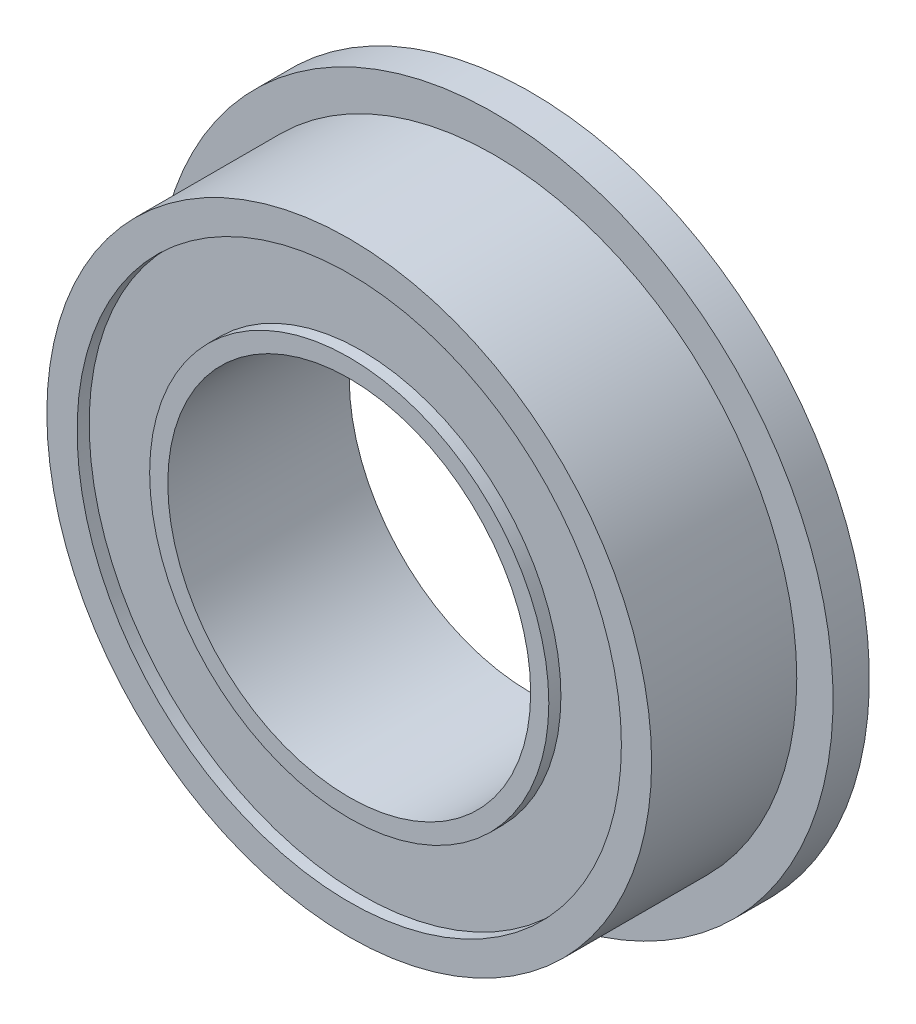
ISO-10303-21;
HEADER;
FILE_DESCRIPTION(('STEP AP214'),'2;1');
FILE_NAME('part.step','',(''),(''),'','','');
FILE_SCHEMA(('AUTOMOTIVE_DESIGN { 1 0 10303 214 1 1 1 1 }'));
ENDSEC;
DATA;
#1=APPLICATION_CONTEXT('core data for automotive mechanical design processes');
#2=APPLICATION_PROTOCOL_DEFINITION('international standard','automotive_design',2000,#1);
#3=PRODUCT_CONTEXT('',#1,'mechanical');
#4=PRODUCT('Part','Part','',(#3));
#5=PRODUCT_RELATED_PRODUCT_CATEGORY('part','',(#4));
#6=PRODUCT_DEFINITION_FORMATION('','',#4);
#7=PRODUCT_DEFINITION_CONTEXT('part definition',#1,'design');
#8=PRODUCT_DEFINITION('design','',#6,#7);
#9=PRODUCT_DEFINITION_SHAPE('','',#8);
#10=(LENGTH_UNIT() NAMED_UNIT(*) SI_UNIT(.MILLI.,.METRE.));
#11=(NAMED_UNIT(*) PLANE_ANGLE_UNIT() SI_UNIT($,.RADIAN.));
#12=(NAMED_UNIT(*) SI_UNIT($,.STERADIAN.) SOLID_ANGLE_UNIT());
#13=UNCERTAINTY_MEASURE_WITH_UNIT(LENGTH_MEASURE(1.E-05),#10,'distance_accuracy_value','');
#14=(GEOMETRIC_REPRESENTATION_CONTEXT(3) GLOBAL_UNCERTAINTY_ASSIGNED_CONTEXT((#13)) GLOBAL_UNIT_ASSIGNED_CONTEXT((#10,
#11,#12)) REPRESENTATION_CONTEXT('',''));
#15=CARTESIAN_POINT('',(0.,0.,0.));
#16=DIRECTION('',(0.,0.,1.));
#17=DIRECTION('',(1.,0.,0.));
#18=AXIS2_PLACEMENT_3D('',#15,#16,#17);
#19=CARTESIAN_POINT('',(0.,0.,-1.5));
#20=DIRECTION('',(0.,0.,1.));
#21=DIRECTION('',(1.,0.,0.));
#22=AXIS2_PLACEMENT_3D('',#19,#20,#21);
#23=PLANE('',#22);
#24=CARTESIAN_POINT('',(0.,0.,-1.5));
#25=DIRECTION('',(0.,0.,1.));
#26=DIRECTION('',(1.,0.,0.));
#27=AXIS2_PLACEMENT_3D('',#24,#25,#26);
#28=CIRCLE('',#27,3.);
#29=CARTESIAN_POINT('',(3.,0.,-1.5));
#30=VERTEX_POINT('',#29);
#31=EDGE_CURVE('E60',#30,#30,#28,.T.);
#32=ORIENTED_EDGE('',*,*,#31,.T.);
#33=EDGE_LOOP('',(#32));
#34=FACE_BOUND('',#33,.T.);
#35=CARTESIAN_POINT('',(0.,0.,-1.5));
#36=DIRECTION('',(0.,0.,1.));
#37=DIRECTION('',(1.,0.,0.));
#38=AXIS2_PLACEMENT_3D('',#35,#36,#37);
#39=CIRCLE('',#38,3.3);
#40=CARTESIAN_POINT('',(3.3,0.,-1.5));
#41=VERTEX_POINT('',#40);
#42=EDGE_CURVE('E94',#41,#41,#39,.T.);
#43=ORIENTED_EDGE('',*,*,#42,.F.);
#44=EDGE_LOOP('',(#43));
#45=FACE_BOUND('',#44,.T.);
#46=ADVANCED_FACE('F37',(#34,#45),#23,.F.);
#47=CARTESIAN_POINT('',(0.,0.,1.5));
#48=DIRECTION('',(0.,0.,1.));
#49=DIRECTION('',(1.,0.,0.));
#50=AXIS2_PLACEMENT_3D('',#47,#48,#49);
#51=PLANE('',#50);
#52=CARTESIAN_POINT('',(0.,0.,1.5));
#53=DIRECTION('',(0.,0.,1.));
#54=DIRECTION('',(1.,0.,0.));
#55=AXIS2_PLACEMENT_3D('',#52,#53,#54);
#56=CIRCLE('',#55,3.);
#57=CARTESIAN_POINT('',(3.,0.,1.5));
#58=VERTEX_POINT('',#57);
#59=EDGE_CURVE('E62',#58,#58,#56,.T.);
#60=ORIENTED_EDGE('',*,*,#59,.F.);
#61=EDGE_LOOP('',(#60));
#62=FACE_BOUND('',#61,.T.);
#63=CARTESIAN_POINT('',(0.,0.,1.5));
#64=DIRECTION('',(0.,0.,1.));
#65=DIRECTION('',(1.,0.,0.));
#66=AXIS2_PLACEMENT_3D('',#63,#64,#65);
#67=CIRCLE('',#66,3.3);
#68=CARTESIAN_POINT('',(3.3,0.,1.5));
#69=VERTEX_POINT('',#68);
#70=EDGE_CURVE('E78',#69,#69,#67,.T.);
#71=ORIENTED_EDGE('',*,*,#70,.T.);
#72=EDGE_LOOP('',(#71));
#73=FACE_BOUND('',#72,.T.);
#74=ADVANCED_FACE('F112',(#62,#73),#51,.T.);
#75=CARTESIAN_POINT('',(0.,0.,1.5));
#76=DIRECTION('',(0.,0.,-1.));
#77=DIRECTION('',(-1.,0.,0.));
#78=AXIS2_PLACEMENT_3D('',#75,#76,#77);
#79=CYLINDRICAL_SURFACE('',#78,5.);
#80=CARTESIAN_POINT('',(0.,0.,1.5));
#81=DIRECTION('',(0.,0.,1.));
#82=DIRECTION('',(1.,0.,0.));
#83=AXIS2_PLACEMENT_3D('',#80,#81,#82);
#84=CIRCLE('',#83,5.);
#85=CARTESIAN_POINT('',(5.,0.,1.5));
#86=VERTEX_POINT('',#85);
#87=EDGE_CURVE('E45',#86,#86,#84,.T.);
#88=ORIENTED_EDGE('',*,*,#87,.F.);
#89=EDGE_LOOP('',(#88));
#90=FACE_BOUND('',#89,.T.);
#91=CARTESIAN_POINT('',(0.,0.,-0.9));
#92=DIRECTION('',(0.,0.,-1.));
#93=DIRECTION('',(-1.,0.,0.));
#94=AXIS2_PLACEMENT_3D('',#91,#92,#93);
#95=CIRCLE('',#94,5.);
#96=CARTESIAN_POINT('',(-5.,0.,-0.9));
#97=VERTEX_POINT('',#96);
#98=EDGE_CURVE('E10',#97,#97,#95,.T.);
#99=ORIENTED_EDGE('',*,*,#98,.F.);
#100=EDGE_LOOP('',(#99));
#101=FACE_BOUND('',#100,.T.);
#102=ADVANCED_FACE('F39',(#90,#101),#79,.T.);
#103=CARTESIAN_POINT('',(0.,0.,1.5));
#104=DIRECTION('',(0.,0.,1.));
#105=DIRECTION('',(1.,0.,0.));
#106=AXIS2_PLACEMENT_3D('',#103,#104,#105);
#107=CIRCLE('',#106,4.5);
#108=CARTESIAN_POINT('',(4.5,0.,1.5));
#109=VERTEX_POINT('',#108);
#110=EDGE_CURVE('E70',#109,#109,#107,.T.);
#111=ORIENTED_EDGE('',*,*,#110,.F.);
#112=EDGE_LOOP('',(#111));
#113=FACE_BOUND('',#112,.T.);
#114=ORIENTED_EDGE('',*,*,#87,.T.);
#115=EDGE_LOOP('',(#114));
#116=FACE_BOUND('',#115,.T.);
#117=ADVANCED_FACE('F120',(#113,#116),#51,.T.);
#118=CARTESIAN_POINT('',(0.,0.,-0.9));
#119=DIRECTION('',(0.,0.,-1.));
#120=DIRECTION('',(-1.,0.,0.));
#121=AXIS2_PLACEMENT_3D('',#118,#119,#120);
#122=CYLINDRICAL_SURFACE('',#121,5.6);
#123=CARTESIAN_POINT('',(0.,0.,-0.9));
#124=DIRECTION('',(0.,0.,-1.));
#125=DIRECTION('',(-1.,0.,0.));
#126=AXIS2_PLACEMENT_3D('',#123,#124,#125);
#127=CIRCLE('',#126,5.6);
#128=CARTESIAN_POINT('',(-5.6,0.,-0.9));
#129=VERTEX_POINT('',#128);
#130=EDGE_CURVE('E50',#129,#129,#127,.T.);
#131=ORIENTED_EDGE('',*,*,#130,.T.);
#132=EDGE_LOOP('',(#131));
#133=FACE_BOUND('',#132,.T.);
#134=CARTESIAN_POINT('',(0.,0.,-1.5));
#135=DIRECTION('',(0.,0.,-1.));
#136=DIRECTION('',(-1.,0.,0.));
#137=AXIS2_PLACEMENT_3D('',#134,#135,#136);
#138=CIRCLE('',#137,5.6);
#139=CARTESIAN_POINT('',(-5.6,0.,-1.5));
#140=VERTEX_POINT('',#139);
#141=EDGE_CURVE('E55',#140,#140,#138,.T.);
#142=ORIENTED_EDGE('',*,*,#141,.F.);
#143=EDGE_LOOP('',(#142));
#144=FACE_BOUND('',#143,.T.);
#145=ADVANCED_FACE('F132',(#133,#144),#122,.T.);
#146=CARTESIAN_POINT('',(0.,0.,-0.9));
#147=DIRECTION('',(0.,0.,-1.));
#148=DIRECTION('',(-1.,0.,0.));
#149=AXIS2_PLACEMENT_3D('',#146,#147,#148);
#150=PLANE('',#149);
#151=ORIENTED_EDGE('',*,*,#98,.T.);
#152=EDGE_LOOP('',(#151));
#153=FACE_BOUND('',#152,.T.);
#154=ORIENTED_EDGE('',*,*,#130,.F.);
#155=EDGE_LOOP('',(#154));
#156=FACE_BOUND('',#155,.T.);
#157=ADVANCED_FACE('F123',(#153,#156),#150,.F.);
#158=CARTESIAN_POINT('',(0.,0.,-1.5));
#159=DIRECTION('',(0.,0.,1.));
#160=DIRECTION('',(1.,0.,0.));
#161=AXIS2_PLACEMENT_3D('',#158,#159,#160);
#162=CIRCLE('',#161,4.5);
#163=CARTESIAN_POINT('',(4.5,0.,-1.5));
#164=VERTEX_POINT('',#163);
#165=EDGE_CURVE('E86',#164,#164,#162,.T.);
#166=ORIENTED_EDGE('',*,*,#165,.T.);
#167=EDGE_LOOP('',(#166));
#168=FACE_BOUND('',#167,.T.);
#169=ORIENTED_EDGE('',*,*,#141,.T.);
#170=EDGE_LOOP('',(#169));
#171=FACE_BOUND('',#170,.T.);
#172=ADVANCED_FACE('F114',(#168,#171),#23,.F.);
#173=CARTESIAN_POINT('',(0.,0.,-1.5));
#174=DIRECTION('',(0.,0.,1.));
#175=DIRECTION('',(1.,0.,0.));
#176=AXIS2_PLACEMENT_3D('',#173,#174,#175);
#177=CYLINDRICAL_SURFACE('',#176,3.);
#178=ORIENTED_EDGE('',*,*,#31,.F.);
#179=EDGE_LOOP('',(#178));
#180=FACE_BOUND('',#179,.T.);
#181=ORIENTED_EDGE('',*,*,#59,.T.);
#182=EDGE_LOOP('',(#181));
#183=FACE_BOUND('',#182,.T.);
#184=ADVANCED_FACE('F122',(#180,#183),#177,.F.);
#185=CARTESIAN_POINT('',(0.,0.,1.3));
#186=DIRECTION('',(0.,0.,1.));
#187=DIRECTION('',(1.,0.,0.));
#188=AXIS2_PLACEMENT_3D('',#185,#186,#187);
#189=CYLINDRICAL_SURFACE('',#188,4.5);
#190=CARTESIAN_POINT('',(0.,0.,1.3));
#191=DIRECTION('',(0.,0.,1.));
#192=DIRECTION('',(1.,0.,0.));
#193=AXIS2_PLACEMENT_3D('',#190,#191,#192);
#194=CIRCLE('',#193,4.5);
#195=CARTESIAN_POINT('',(4.5,0.,1.3));
#196=VERTEX_POINT('',#195);
#197=EDGE_CURVE('E66',#196,#196,#194,.T.);
#198=ORIENTED_EDGE('',*,*,#197,.F.);
#199=EDGE_LOOP('',(#198));
#200=FACE_BOUND('',#199,.T.);
#201=ORIENTED_EDGE('',*,*,#110,.T.);
#202=EDGE_LOOP('',(#201));
#203=FACE_BOUND('',#202,.T.);
#204=ADVANCED_FACE('F129',(#200,#203),#189,.F.);
#205=CARTESIAN_POINT('',(0.,0.,1.3));
#206=DIRECTION('',(0.,0.,1.));
#207=DIRECTION('',(1.,0.,0.));
#208=AXIS2_PLACEMENT_3D('',#205,#206,#207);
#209=PLANE('',#208);
#210=CARTESIAN_POINT('',(0.,0.,1.3));
#211=DIRECTION('',(0.,0.,1.));
#212=DIRECTION('',(1.,0.,0.));
#213=AXIS2_PLACEMENT_3D('',#210,#211,#212);
#214=CIRCLE('',#213,3.3);
#215=CARTESIAN_POINT('',(3.3,0.,1.3));
#216=VERTEX_POINT('',#215);
#217=EDGE_CURVE('E74',#216,#216,#214,.T.);
#218=ORIENTED_EDGE('',*,*,#217,.F.);
#219=EDGE_LOOP('',(#218));
#220=FACE_BOUND('',#219,.T.);
#221=ORIENTED_EDGE('',*,*,#197,.T.);
#222=EDGE_LOOP('',(#221));
#223=FACE_BOUND('',#222,.T.);
#224=ADVANCED_FACE('F148',(#220,#223),#209,.T.);
#225=CARTESIAN_POINT('',(0.,0.,1.3));
#226=DIRECTION('',(0.,0.,1.));
#227=DIRECTION('',(1.,0.,0.));
#228=AXIS2_PLACEMENT_3D('',#225,#226,#227);
#229=CYLINDRICAL_SURFACE('',#228,3.3);
#230=ORIENTED_EDGE('',*,*,#217,.T.);
#231=EDGE_LOOP('',(#230));
#232=FACE_BOUND('',#231,.T.);
#233=ORIENTED_EDGE('',*,*,#70,.F.);
#234=EDGE_LOOP('',(#233));
#235=FACE_BOUND('',#234,.T.);
#236=ADVANCED_FACE('F152',(#232,#235),#229,.T.);
#237=CARTESIAN_POINT('',(0.,0.,-1.3));
#238=DIRECTION('',(0.,0.,-1.));
#239=DIRECTION('',(1.,0.,0.));
#240=AXIS2_PLACEMENT_3D('',#237,#238,#239);
#241=PLANE('',#240);
#242=CARTESIAN_POINT('',(0.,0.,-1.3));
#243=DIRECTION('',(0.,0.,1.));
#244=DIRECTION('',(1.,0.,0.));
#245=AXIS2_PLACEMENT_3D('',#242,#243,#244);
#246=CIRCLE('',#245,4.5);
#247=CARTESIAN_POINT('',(4.5,0.,-1.3));
#248=VERTEX_POINT('',#247);
#249=EDGE_CURVE('E82',#248,#248,#246,.T.);
#250=ORIENTED_EDGE('',*,*,#249,.F.);
#251=EDGE_LOOP('',(#250));
#252=FACE_BOUND('',#251,.T.);
#253=CARTESIAN_POINT('',(0.,0.,-1.3));
#254=DIRECTION('',(0.,0.,1.));
#255=DIRECTION('',(1.,0.,0.));
#256=AXIS2_PLACEMENT_3D('',#253,#254,#255);
#257=CIRCLE('',#256,3.3);
#258=CARTESIAN_POINT('',(3.3,0.,-1.3));
#259=VERTEX_POINT('',#258);
#260=EDGE_CURVE('E90',#259,#259,#257,.T.);
#261=ORIENTED_EDGE('',*,*,#260,.T.);
#262=EDGE_LOOP('',(#261));
#263=FACE_BOUND('',#262,.T.);
#264=ADVANCED_FACE('F102',(#252,#263),#241,.T.);
#265=CARTESIAN_POINT('',(0.,0.,-1.3));
#266=DIRECTION('',(0.,0.,-1.));
#267=DIRECTION('',(-1.,0.,0.));
#268=AXIS2_PLACEMENT_3D('',#265,#266,#267);
#269=CYLINDRICAL_SURFACE('',#268,4.5);
#270=ORIENTED_EDGE('',*,*,#249,.T.);
#271=EDGE_LOOP('',(#270));
#272=FACE_BOUND('',#271,.T.);
#273=ORIENTED_EDGE('',*,*,#165,.F.);
#274=EDGE_LOOP('',(#273));
#275=FACE_BOUND('',#274,.T.);
#276=ADVANCED_FACE('F107',(#272,#275),#269,.F.);
#277=CARTESIAN_POINT('',(0.,0.,-1.3));
#278=DIRECTION('',(0.,0.,-1.));
#279=DIRECTION('',(-1.,0.,0.));
#280=AXIS2_PLACEMENT_3D('',#277,#278,#279);
#281=CYLINDRICAL_SURFACE('',#280,3.3);
#282=ORIENTED_EDGE('',*,*,#260,.F.);
#283=EDGE_LOOP('',(#282));
#284=FACE_BOUND('',#283,.T.);
#285=ORIENTED_EDGE('',*,*,#42,.T.);
#286=EDGE_LOOP('',(#285));
#287=FACE_BOUND('',#286,.T.);
#288=ADVANCED_FACE('F104',(#284,#287),#281,.T.);
#289=CLOSED_SHELL('',(#46,#74,#102,#117,#145,#157,#172,#184,#204,#224,#236,#264,#276,#288));
#290=MANIFOLD_SOLID_BREP('B2',#289);
#291=ADVANCED_BREP_SHAPE_REPRESENTATION('',(#18,#290),#14);
#292=SHAPE_DEFINITION_REPRESENTATION(#9,#291);
ENDSEC;
END-ISO-10303-21;
